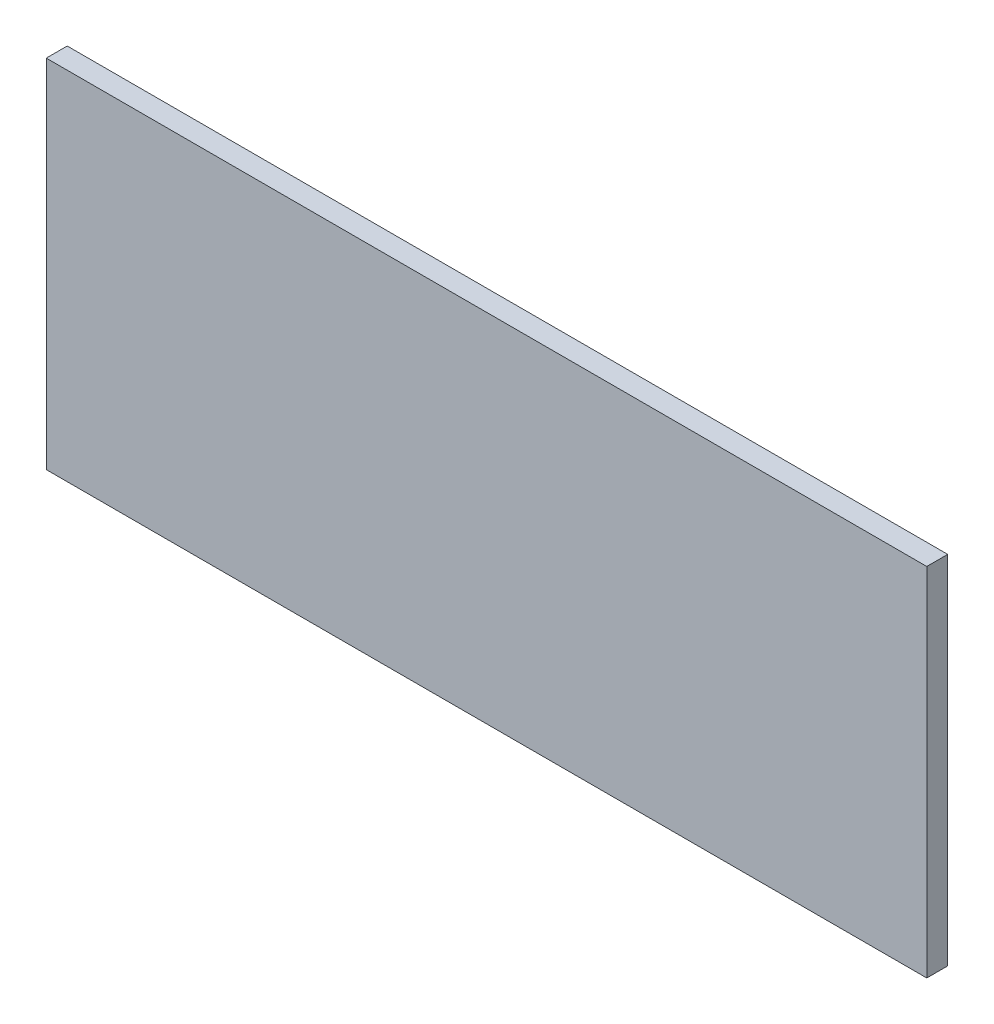
ISO-10303-21;
HEADER;
FILE_DESCRIPTION(('STEP AP214'),'2;1');
FILE_NAME('part.step','',(''),(''),'','','');
FILE_SCHEMA(('AUTOMOTIVE_DESIGN { 1 0 10303 214 1 1 1 1 }'));
ENDSEC;
DATA;
#1=APPLICATION_CONTEXT('core data for automotive mechanical design processes');
#2=APPLICATION_PROTOCOL_DEFINITION('international standard','automotive_design',2000,#1);
#3=PRODUCT_CONTEXT('',#1,'mechanical');
#4=PRODUCT('Part','Part','',(#3));
#5=PRODUCT_RELATED_PRODUCT_CATEGORY('part','',(#4));
#6=PRODUCT_DEFINITION_FORMATION('','',#4);
#7=PRODUCT_DEFINITION_CONTEXT('part definition',#1,'design');
#8=PRODUCT_DEFINITION('design','',#6,#7);
#9=PRODUCT_DEFINITION_SHAPE('','',#8);
#10=(LENGTH_UNIT() NAMED_UNIT(*) SI_UNIT(.MILLI.,.METRE.));
#11=(NAMED_UNIT(*) PLANE_ANGLE_UNIT() SI_UNIT($,.RADIAN.));
#12=(NAMED_UNIT(*) SI_UNIT($,.STERADIAN.) SOLID_ANGLE_UNIT());
#13=UNCERTAINTY_MEASURE_WITH_UNIT(LENGTH_MEASURE(1.E-05),#10,'distance_accuracy_value','');
#14=(GEOMETRIC_REPRESENTATION_CONTEXT(3) GLOBAL_UNCERTAINTY_ASSIGNED_CONTEXT((#13)) GLOBAL_UNIT_ASSIGNED_CONTEXT((#10,
#11,#12)) REPRESENTATION_CONTEXT('',''));
#15=CARTESIAN_POINT('',(0.,0.,0.));
#16=DIRECTION('',(0.,0.,1.));
#17=DIRECTION('',(1.,0.,0.));
#18=AXIS2_PLACEMENT_3D('',#15,#16,#17);
#19=CARTESIAN_POINT('',(0.,0.,5.));
#20=DIRECTION('',(1.,0.,0.));
#21=DIRECTION('',(0.,0.,-1.));
#22=AXIS2_PLACEMENT_3D('',#19,#20,#21);
#23=PLANE('',#22);
#24=DIRECTION('',(0.,-1.,0.));
#25=VECTOR('',#24,1.);
#26=CARTESIAN_POINT('',(0.,0.,0.));
#27=LINE('',#26,#25);
#28=CARTESIAN_POINT('',(0.,85.,0.));
#29=VERTEX_POINT('',#28);
#30=CARTESIAN_POINT('',(0.,0.,0.));
#31=VERTEX_POINT('',#30);
#32=EDGE_CURVE('E99',#29,#31,#27,.T.);
#33=ORIENTED_EDGE('',*,*,#32,.T.);
#34=DIRECTION('',(0.,0.,-1.));
#35=VECTOR('',#34,1.);
#36=CARTESIAN_POINT('',(0.,0.,5.));
#37=LINE('',#36,#35);
#38=CARTESIAN_POINT('',(0.,0.,5.));
#39=VERTEX_POINT('',#38);
#40=EDGE_CURVE('E11',#39,#31,#37,.T.);
#41=ORIENTED_EDGE('',*,*,#40,.F.);
#42=DIRECTION('',(0.,-1.,0.));
#43=VECTOR('',#42,1.);
#44=CARTESIAN_POINT('',(0.,0.,5.));
#45=LINE('',#44,#43);
#46=CARTESIAN_POINT('',(0.,85.,5.));
#47=VERTEX_POINT('',#46);
#48=EDGE_CURVE('E87',#47,#39,#45,.T.);
#49=ORIENTED_EDGE('',*,*,#48,.F.);
#50=DIRECTION('',(0.,0.,-1.));
#51=VECTOR('',#50,1.);
#52=CARTESIAN_POINT('',(0.,85.,5.));
#53=LINE('',#52,#51);
#54=EDGE_CURVE('E95',#47,#29,#53,.T.);
#55=ORIENTED_EDGE('',*,*,#54,.T.);
#56=EDGE_LOOP('',(#33,#41,#49,#55));
#57=FACE_BOUND('',#56,.T.);
#58=ADVANCED_FACE('F36',(#57),#23,.F.);
#59=CARTESIAN_POINT('',(0.,0.,5.));
#60=DIRECTION('',(0.,1.,0.));
#61=DIRECTION('',(0.,0.,1.));
#62=AXIS2_PLACEMENT_3D('',#59,#60,#61);
#63=PLANE('',#62);
#64=DIRECTION('',(1.,0.,0.));
#65=VECTOR('',#64,1.);
#66=CARTESIAN_POINT('',(0.,0.,0.));
#67=LINE('',#66,#65);
#68=CARTESIAN_POINT('',(210.,0.,0.));
#69=VERTEX_POINT('',#68);
#70=EDGE_CURVE('E91',#31,#69,#67,.T.);
#71=ORIENTED_EDGE('',*,*,#70,.T.);
#72=DIRECTION('',(0.,0.,-1.));
#73=VECTOR('',#72,1.);
#74=CARTESIAN_POINT('',(210.,0.,5.));
#75=LINE('',#74,#73);
#76=CARTESIAN_POINT('',(210.,0.,5.));
#77=VERTEX_POINT('',#76);
#78=EDGE_CURVE('E44',#77,#69,#75,.T.);
#79=ORIENTED_EDGE('',*,*,#78,.F.);
#80=DIRECTION('',(1.,0.,0.));
#81=VECTOR('',#80,1.);
#82=CARTESIAN_POINT('',(0.,0.,5.));
#83=LINE('',#82,#81);
#84=EDGE_CURVE('E82',#39,#77,#83,.T.);
#85=ORIENTED_EDGE('',*,*,#84,.F.);
#86=ORIENTED_EDGE('',*,*,#40,.T.);
#87=EDGE_LOOP('',(#71,#79,#85,#86));
#88=FACE_BOUND('',#87,.T.);
#89=ADVANCED_FACE('F90',(#88),#63,.F.);
#90=CARTESIAN_POINT('',(210.,0.,5.));
#91=DIRECTION('',(-1.,0.,0.));
#92=DIRECTION('',(0.,-1.,0.));
#93=AXIS2_PLACEMENT_3D('',#90,#91,#92);
#94=PLANE('',#93);
#95=DIRECTION('',(0.,1.,0.));
#96=VECTOR('',#95,1.);
#97=CARTESIAN_POINT('',(210.,0.,0.));
#98=LINE('',#97,#96);
#99=CARTESIAN_POINT('',(210.,85.,0.));
#100=VERTEX_POINT('',#99);
#101=EDGE_CURVE('E69',#69,#100,#98,.T.);
#102=ORIENTED_EDGE('',*,*,#101,.T.);
#103=DIRECTION('',(0.,0.,-1.));
#104=VECTOR('',#103,1.);
#105=CARTESIAN_POINT('',(210.,85.,5.));
#106=LINE('',#105,#104);
#107=CARTESIAN_POINT('',(210.,85.,5.));
#108=VERTEX_POINT('',#107);
#109=EDGE_CURVE('E92',#108,#100,#106,.T.);
#110=ORIENTED_EDGE('',*,*,#109,.F.);
#111=DIRECTION('',(0.,1.,0.));
#112=VECTOR('',#111,1.);
#113=CARTESIAN_POINT('',(210.,0.,5.));
#114=LINE('',#113,#112);
#115=EDGE_CURVE('E85',#77,#108,#114,.T.);
#116=ORIENTED_EDGE('',*,*,#115,.F.);
#117=ORIENTED_EDGE('',*,*,#78,.T.);
#118=EDGE_LOOP('',(#102,#110,#116,#117));
#119=FACE_BOUND('',#118,.T.);
#120=ADVANCED_FACE('F93',(#119),#94,.F.);
#121=CARTESIAN_POINT('',(0.,85.,5.));
#122=DIRECTION('',(0.,-1.,0.));
#123=DIRECTION('',(0.,0.,-1.));
#124=AXIS2_PLACEMENT_3D('',#121,#122,#123);
#125=PLANE('',#124);
#126=DIRECTION('',(-1.,0.,0.));
#127=VECTOR('',#126,1.);
#128=CARTESIAN_POINT('',(0.,85.,0.));
#129=LINE('',#128,#127);
#130=EDGE_CURVE('E75',#100,#29,#129,.T.);
#131=ORIENTED_EDGE('',*,*,#130,.T.);
#132=ORIENTED_EDGE('',*,*,#54,.F.);
#133=DIRECTION('',(-1.,0.,0.));
#134=VECTOR('',#133,1.);
#135=CARTESIAN_POINT('',(0.,85.,5.));
#136=LINE('',#135,#134);
#137=EDGE_CURVE('E52',#108,#47,#136,.T.);
#138=ORIENTED_EDGE('',*,*,#137,.F.);
#139=ORIENTED_EDGE('',*,*,#109,.T.);
#140=EDGE_LOOP('',(#131,#132,#138,#139));
#141=FACE_BOUND('',#140,.T.);
#142=ADVANCED_FACE('F106',(#141),#125,.F.);
#143=CARTESIAN_POINT('',(0.,0.,5.));
#144=DIRECTION('',(0.,0.,-1.));
#145=DIRECTION('',(-1.,0.,0.));
#146=AXIS2_PLACEMENT_3D('',#143,#144,#145);
#147=PLANE('',#146);
#148=ORIENTED_EDGE('',*,*,#48,.T.);
#149=ORIENTED_EDGE('',*,*,#84,.T.);
#150=ORIENTED_EDGE('',*,*,#115,.T.);
#151=ORIENTED_EDGE('',*,*,#137,.T.);
#152=EDGE_LOOP('',(#148,#149,#150,#151));
#153=FACE_BOUND('',#152,.T.);
#154=ADVANCED_FACE('F83',(#153),#147,.F.);
#155=CARTESIAN_POINT('',(0.,0.,0.));
#156=DIRECTION('',(0.,0.,-1.));
#157=DIRECTION('',(-1.,0.,0.));
#158=AXIS2_PLACEMENT_3D('',#155,#156,#157);
#159=PLANE('',#158);
#160=ORIENTED_EDGE('',*,*,#32,.F.);
#161=ORIENTED_EDGE('',*,*,#130,.F.);
#162=ORIENTED_EDGE('',*,*,#101,.F.);
#163=ORIENTED_EDGE('',*,*,#70,.F.);
#164=EDGE_LOOP('',(#160,#161,#162,#163));
#165=FACE_BOUND('',#164,.T.);
#166=ADVANCED_FACE('F109',(#165),#159,.T.);
#167=CLOSED_SHELL('',(#58,#89,#120,#142,#154,#166));
#168=MANIFOLD_SOLID_BREP('B2',#167);
#169=ADVANCED_BREP_SHAPE_REPRESENTATION('',(#18,#168),#14);
#170=SHAPE_DEFINITION_REPRESENTATION(#9,#169);
ENDSEC;
END-ISO-10303-21;
